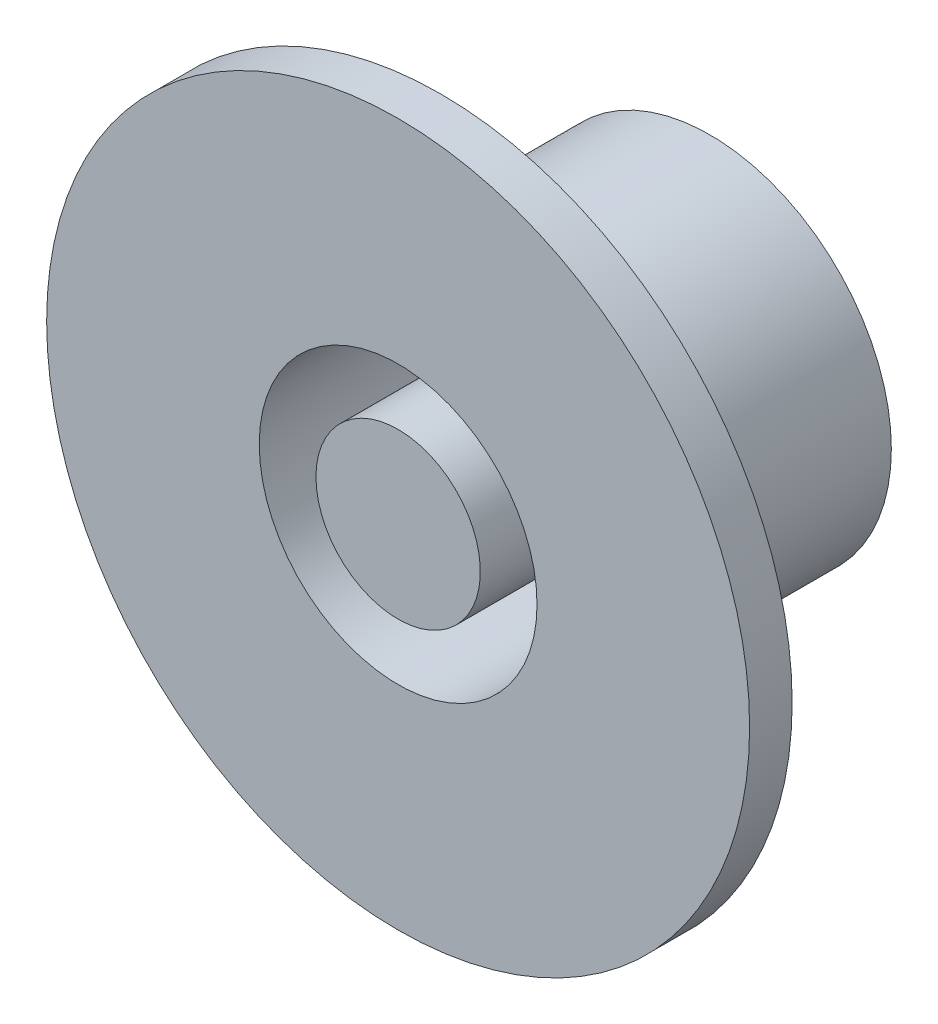
ISO-10303-21;
HEADER;
FILE_DESCRIPTION(('STEP AP214'),'2;1');
FILE_NAME('part.step','',(''),(''),'','','');
FILE_SCHEMA(('AUTOMOTIVE_DESIGN { 1 0 10303 214 1 1 1 1 }'));
ENDSEC;
DATA;
#1=APPLICATION_CONTEXT('core data for automotive mechanical design processes');
#2=APPLICATION_PROTOCOL_DEFINITION('international standard','automotive_design',2000,#1);
#3=PRODUCT_CONTEXT('',#1,'mechanical');
#4=PRODUCT('Part','Part','',(#3));
#5=PRODUCT_RELATED_PRODUCT_CATEGORY('part','',(#4));
#6=PRODUCT_DEFINITION_FORMATION('','',#4);
#7=PRODUCT_DEFINITION_CONTEXT('part definition',#1,'design');
#8=PRODUCT_DEFINITION('design','',#6,#7);
#9=PRODUCT_DEFINITION_SHAPE('','',#8);
#10=(LENGTH_UNIT() NAMED_UNIT(*) SI_UNIT(.MILLI.,.METRE.));
#11=(NAMED_UNIT(*) PLANE_ANGLE_UNIT() SI_UNIT($,.RADIAN.));
#12=(NAMED_UNIT(*) SI_UNIT($,.STERADIAN.) SOLID_ANGLE_UNIT());
#13=UNCERTAINTY_MEASURE_WITH_UNIT(LENGTH_MEASURE(1.E-05),#10,'distance_accuracy_value','');
#14=(GEOMETRIC_REPRESENTATION_CONTEXT(3) GLOBAL_UNCERTAINTY_ASSIGNED_CONTEXT((#13)) GLOBAL_UNIT_ASSIGNED_CONTEXT((#10,
#11,#12)) REPRESENTATION_CONTEXT('',''));
#15=CARTESIAN_POINT('',(0.,0.,0.));
#16=DIRECTION('',(0.,0.,1.));
#17=DIRECTION('',(1.,0.,0.));
#18=AXIS2_PLACEMENT_3D('',#15,#16,#17);
#19=CARTESIAN_POINT('',(0.,0.,22.));
#20=DIRECTION('',(0.,0.,1.));
#21=DIRECTION('',(1.,0.,0.));
#22=AXIS2_PLACEMENT_3D('',#19,#20,#21);
#23=PLANE('',#22);
#24=CARTESIAN_POINT('',(0.,0.,22.));
#25=DIRECTION('',(0.,0.,-1.));
#26=DIRECTION('',(-1.,0.,0.));
#27=AXIS2_PLACEMENT_3D('',#24,#25,#26);
#28=CIRCLE('',#27,5.8);
#29=CARTESIAN_POINT('',(-5.8,0.,22.));
#30=VERTEX_POINT('',#29);
#31=EDGE_CURVE('E10',#30,#30,#28,.T.);
#32=ORIENTED_EDGE('',*,*,#31,.F.);
#33=EDGE_LOOP('',(#32));
#34=FACE_BOUND('',#33,.T.);
#35=ADVANCED_FACE('F37',(#34),#23,.T.);
#36=CARTESIAN_POINT('',(0.,0.,0.));
#37=DIRECTION('',(0.,0.,-1.));
#38=DIRECTION('',(-1.,0.,0.));
#39=AXIS2_PLACEMENT_3D('',#36,#37,#38);
#40=CYLINDRICAL_SURFACE('',#39,5.8);
#41=ORIENTED_EDGE('',*,*,#31,.T.);
#42=EDGE_LOOP('',(#41));
#43=FACE_BOUND('',#42,.T.);
#44=CARTESIAN_POINT('',(0.,0.,3.));
#45=DIRECTION('',(0.,0.,-1.));
#46=DIRECTION('',(-1.,0.,0.));
#47=AXIS2_PLACEMENT_3D('',#44,#45,#46);
#48=CIRCLE('',#47,5.8);
#49=CARTESIAN_POINT('',(-5.8,0.,3.));
#50=VERTEX_POINT('',#49);
#51=EDGE_CURVE('E44',#50,#50,#48,.T.);
#52=ORIENTED_EDGE('',*,*,#51,.F.);
#53=EDGE_LOOP('',(#52));
#54=FACE_BOUND('',#53,.T.);
#55=ADVANCED_FACE('F164',(#43,#54),#40,.T.);
#56=CARTESIAN_POINT('',(0.,5.8,3.));
#57=DIRECTION('',(0.,0.,1.));
#58=DIRECTION('',(1.,0.,0.));
#59=AXIS2_PLACEMENT_3D('',#56,#57,#58);
#60=PLANE('',#59);
#61=CARTESIAN_POINT('',(7.50000000000032,3.18366503443004E-13,3.));
#62=DIRECTION('',(0.,0.,1.));
#63=DIRECTION('',(1.,0.,0.));
#64=AXIS2_PLACEMENT_3D('',#61,#62,#63);
#65=CIRCLE('',#64,1.05000000000024);
#66=CARTESIAN_POINT('',(8.55000000000055,3.18366503443004E-13,3.));
#67=VERTEX_POINT('',#66);
#68=EDGE_CURVE('E118',#67,#67,#65,.T.);
#69=ORIENTED_EDGE('',*,*,#68,.F.);
#70=EDGE_LOOP('',(#69));
#71=FACE_BOUND('',#70,.T.);
#72=CARTESIAN_POINT('',(5.30330085889965,-5.30330085889888,3.));
#73=DIRECTION('',(0.,0.,1.));
#74=DIRECTION('',(1.,0.,0.));
#75=AXIS2_PLACEMENT_3D('',#72,#73,#74);
#76=CIRCLE('',#75,1.05000000000049);
#77=CARTESIAN_POINT('',(6.35330085890014,-5.30330085889888,3.));
#78=VERTEX_POINT('',#77);
#79=EDGE_CURVE('E110',#78,#78,#76,.T.);
#80=ORIENTED_EDGE('',*,*,#79,.F.);
#81=EDGE_LOOP('',(#80));
#82=FACE_BOUND('',#81,.T.);
#83=CARTESIAN_POINT('',(6.36733006886009E-13,-7.5,3.));
#84=DIRECTION('',(0.,0.,1.));
#85=DIRECTION('',(1.,0.,0.));
#86=AXIS2_PLACEMENT_3D('',#83,#84,#85);
#87=CIRCLE('',#86,1.05000000000066);
#88=CARTESIAN_POINT('',(1.0500000000013,-7.5,3.));
#89=VERTEX_POINT('',#88);
#90=EDGE_CURVE('E102',#89,#89,#87,.T.);
#91=ORIENTED_EDGE('',*,*,#90,.F.);
#92=EDGE_LOOP('',(#91));
#93=FACE_BOUND('',#92,.T.);
#94=CARTESIAN_POINT('',(-5.30330085889856,-5.30330085889933,3.));
#95=DIRECTION('',(0.,0.,1.));
#96=DIRECTION('',(1.,0.,0.));
#97=AXIS2_PLACEMENT_3D('',#94,#95,#96);
#98=CIRCLE('',#97,1.05000000000065);
#99=CARTESIAN_POINT('',(-4.25330085889791,-5.30330085889933,3.));
#100=VERTEX_POINT('',#99);
#101=EDGE_CURVE('E93',#100,#100,#98,.T.);
#102=ORIENTED_EDGE('',*,*,#101,.F.);
#103=EDGE_LOOP('',(#102));
#104=FACE_BOUND('',#103,.T.);
#105=CARTESIAN_POINT('',(-5.30330085889904,5.30330085889917,3.));
#106=DIRECTION('',(0.,0.,1.));
#107=DIRECTION('',(1.,0.,0.));
#108=AXIS2_PLACEMENT_3D('',#105,#106,#107);
#109=CIRCLE('',#108,1.05);
#110=CARTESIAN_POINT('',(-4.25330085889904,5.30330085889917,3.));
#111=VERTEX_POINT('',#110);
#112=EDGE_CURVE('E141',#111,#111,#109,.T.);
#113=ORIENTED_EDGE('',*,*,#112,.F.);
#114=EDGE_LOOP('',(#113));
#115=FACE_BOUND('',#114,.T.);
#116=CARTESIAN_POINT('',(0.,7.5,3.));
#117=DIRECTION('',(0.,0.,1.));
#118=DIRECTION('',(1.,0.,0.));
#119=AXIS2_PLACEMENT_3D('',#116,#117,#118);
#120=CIRCLE('',#119,1.05);
#121=CARTESIAN_POINT('',(1.05,7.5,3.));
#122=VERTEX_POINT('',#121);
#123=EDGE_CURVE('E125',#122,#122,#120,.T.);
#124=ORIENTED_EDGE('',*,*,#123,.F.);
#125=EDGE_LOOP('',(#124));
#126=FACE_BOUND('',#125,.T.);
#127=CARTESIAN_POINT('',(-7.49999999999968,-3.19284988542365E-13,3.));
#128=DIRECTION('',(0.,0.,1.));
#129=DIRECTION('',(1.,0.,0.));
#130=AXIS2_PLACEMENT_3D('',#127,#128,#129);
#131=CIRCLE('',#130,1.05000000000047);
#132=CARTESIAN_POINT('',(-6.44999999999921,-3.19284988542365E-13,3.));
#133=VERTEX_POINT('',#132);
#134=EDGE_CURVE('E134',#133,#133,#131,.T.);
#135=ORIENTED_EDGE('',*,*,#134,.F.);
#136=EDGE_LOOP('',(#135));
#137=FACE_BOUND('',#136,.T.);
#138=CARTESIAN_POINT('',(5.30330085889912,5.3033008588991,3.));
#139=DIRECTION('',(0.,0.,1.));
#140=DIRECTION('',(1.,0.,0.));
#141=AXIS2_PLACEMENT_3D('',#138,#139,#140);
#142=CIRCLE('',#141,1.05);
#143=CARTESIAN_POINT('',(6.35330085889912,5.3033008588991,3.));
#144=VERTEX_POINT('',#143);
#145=EDGE_CURVE('E85',#144,#144,#142,.T.);
#146=ORIENTED_EDGE('',*,*,#145,.F.);
#147=EDGE_LOOP('',(#146));
#148=FACE_BOUND('',#147,.T.);
#149=ORIENTED_EDGE('',*,*,#51,.T.);
#150=EDGE_LOOP('',(#149));
#151=FACE_BOUND('',#150,.T.);
#152=CARTESIAN_POINT('',(0.,0.,3.));
#153=DIRECTION('',(0.,0.,-1.));
#154=DIRECTION('',(-1.,0.,0.));
#155=AXIS2_PLACEMENT_3D('',#152,#153,#154);
#156=CIRCLE('',#155,9.8);
#157=CARTESIAN_POINT('',(-9.8,0.,3.));
#158=VERTEX_POINT('',#157);
#159=EDGE_CURVE('E49',#158,#158,#156,.T.);
#160=ORIENTED_EDGE('',*,*,#159,.F.);
#161=EDGE_LOOP('',(#160));
#162=FACE_BOUND('',#161,.T.);
#163=ADVANCED_FACE('F160',(#71,#82,#93,#104,#115,#126,#137,#148,#151,#162),#60,.T.);
#164=CARTESIAN_POINT('',(0.,0.,0.));
#165=DIRECTION('',(0.,0.,-1.));
#166=DIRECTION('',(-1.,0.,0.));
#167=AXIS2_PLACEMENT_3D('',#164,#165,#166);
#168=CYLINDRICAL_SURFACE('',#167,9.8);
#169=ORIENTED_EDGE('',*,*,#159,.T.);
#170=EDGE_LOOP('',(#169));
#171=FACE_BOUND('',#170,.T.);
#172=CARTESIAN_POINT('',(0.,0.,22.));
#173=DIRECTION('',(0.,0.,-1.));
#174=DIRECTION('',(-1.,0.,0.));
#175=AXIS2_PLACEMENT_3D('',#172,#173,#174);
#176=CIRCLE('',#175,9.8);
#177=CARTESIAN_POINT('',(-9.8,0.,22.));
#178=VERTEX_POINT('',#177);
#179=EDGE_CURVE('E54',#178,#178,#176,.T.);
#180=ORIENTED_EDGE('',*,*,#179,.F.);
#181=EDGE_LOOP('',(#180));
#182=FACE_BOUND('',#181,.T.);
#183=ADVANCED_FACE('F163',(#171,#182),#168,.F.);
#184=CARTESIAN_POINT('',(0.,9.8,22.));
#185=DIRECTION('',(0.,0.,1.));
#186=DIRECTION('',(1.,0.,0.));
#187=AXIS2_PLACEMENT_3D('',#184,#185,#186);
#188=PLANE('',#187);
#189=ORIENTED_EDGE('',*,*,#179,.T.);
#190=EDGE_LOOP('',(#189));
#191=FACE_BOUND('',#190,.T.);
#192=CARTESIAN_POINT('',(0.,0.,22.));
#193=DIRECTION('',(0.,0.,-1.));
#194=DIRECTION('',(-1.,0.,0.));
#195=AXIS2_PLACEMENT_3D('',#192,#193,#194);
#196=CIRCLE('',#195,24.8);
#197=CARTESIAN_POINT('',(-24.8,0.,22.));
#198=VERTEX_POINT('',#197);
#199=EDGE_CURVE('E60',#198,#198,#196,.T.);
#200=ORIENTED_EDGE('',*,*,#199,.F.);
#201=EDGE_LOOP('',(#200));
#202=FACE_BOUND('',#201,.T.);
#203=ADVANCED_FACE('F177',(#191,#202),#188,.T.);
#204=CARTESIAN_POINT('',(0.,0.,0.));
#205=DIRECTION('',(0.,0.,-1.));
#206=DIRECTION('',(-1.,0.,0.));
#207=AXIS2_PLACEMENT_3D('',#204,#205,#206);
#208=CYLINDRICAL_SURFACE('',#207,24.8);
#209=ORIENTED_EDGE('',*,*,#199,.T.);
#210=EDGE_LOOP('',(#209));
#211=FACE_BOUND('',#210,.T.);
#212=CARTESIAN_POINT('',(0.,0.,19.));
#213=DIRECTION('',(0.,0.,-1.));
#214=DIRECTION('',(-1.,0.,0.));
#215=AXIS2_PLACEMENT_3D('',#212,#213,#214);
#216=CIRCLE('',#215,24.8);
#217=CARTESIAN_POINT('',(-24.8,0.,19.));
#218=VERTEX_POINT('',#217);
#219=EDGE_CURVE('E64',#218,#218,#216,.T.);
#220=ORIENTED_EDGE('',*,*,#219,.F.);
#221=EDGE_LOOP('',(#220));
#222=FACE_BOUND('',#221,.T.);
#223=ADVANCED_FACE('F183',(#211,#222),#208,.T.);
#224=CARTESIAN_POINT('',(0.,12.8,19.));
#225=DIRECTION('',(0.,0.,-1.));
#226=DIRECTION('',(-1.,0.,0.));
#227=AXIS2_PLACEMENT_3D('',#224,#225,#226);
#228=PLANE('',#227);
#229=ORIENTED_EDGE('',*,*,#219,.T.);
#230=EDGE_LOOP('',(#229));
#231=FACE_BOUND('',#230,.T.);
#232=CARTESIAN_POINT('',(0.,0.,19.));
#233=DIRECTION('',(0.,0.,-1.));
#234=DIRECTION('',(-1.,0.,0.));
#235=AXIS2_PLACEMENT_3D('',#232,#233,#234);
#236=CIRCLE('',#235,12.8);
#237=CARTESIAN_POINT('',(-12.8,0.,19.));
#238=VERTEX_POINT('',#237);
#239=EDGE_CURVE('E68',#238,#238,#236,.T.);
#240=ORIENTED_EDGE('',*,*,#239,.F.);
#241=EDGE_LOOP('',(#240));
#242=FACE_BOUND('',#241,.T.);
#243=ADVANCED_FACE('F189',(#231,#242),#228,.T.);
#244=CARTESIAN_POINT('',(0.,0.,0.));
#245=DIRECTION('',(0.,0.,-1.));
#246=DIRECTION('',(-1.,0.,0.));
#247=AXIS2_PLACEMENT_3D('',#244,#245,#246);
#248=CYLINDRICAL_SURFACE('',#247,12.8);
#249=ORIENTED_EDGE('',*,*,#239,.T.);
#250=EDGE_LOOP('',(#249));
#251=FACE_BOUND('',#250,.T.);
#252=CARTESIAN_POINT('',(0.,0.,0.));
#253=DIRECTION('',(0.,0.,-1.));
#254=DIRECTION('',(-1.,0.,0.));
#255=AXIS2_PLACEMENT_3D('',#252,#253,#254);
#256=CIRCLE('',#255,12.8);
#257=CARTESIAN_POINT('',(-12.8,0.,0.));
#258=VERTEX_POINT('',#257);
#259=EDGE_CURVE('E72',#258,#258,#256,.T.);
#260=ORIENTED_EDGE('',*,*,#259,.F.);
#261=EDGE_LOOP('',(#260));
#262=FACE_BOUND('',#261,.T.);
#263=ADVANCED_FACE('F195',(#251,#262),#248,.T.);
#264=CARTESIAN_POINT('',(0.,4.,0.));
#265=DIRECTION('',(0.,0.,-1.));
#266=DIRECTION('',(-1.,0.,0.));
#267=AXIS2_PLACEMENT_3D('',#264,#265,#266);
#268=PLANE('',#267);
#269=CARTESIAN_POINT('',(7.50000000000032,3.18366503443004E-13,0.));
#270=DIRECTION('',(0.,0.,1.));
#271=DIRECTION('',(1.,0.,0.));
#272=AXIS2_PLACEMENT_3D('',#269,#270,#271);
#273=CIRCLE('',#272,1.05000000000024);
#274=CARTESIAN_POINT('',(8.55000000000055,3.18366503443004E-13,0.));
#275=VERTEX_POINT('',#274);
#276=EDGE_CURVE('E89',#275,#275,#273,.T.);
#277=ORIENTED_EDGE('',*,*,#276,.T.);
#278=EDGE_LOOP('',(#277));
#279=FACE_BOUND('',#278,.T.);
#280=CARTESIAN_POINT('',(5.30330085889965,-5.30330085889888,0.));
#281=DIRECTION('',(0.,0.,1.));
#282=DIRECTION('',(1.,0.,0.));
#283=AXIS2_PLACEMENT_3D('',#280,#281,#282);
#284=CIRCLE('',#283,1.05000000000049);
#285=CARTESIAN_POINT('',(6.35330085890014,-5.30330085889888,0.));
#286=VERTEX_POINT('',#285);
#287=EDGE_CURVE('E114',#286,#286,#284,.T.);
#288=ORIENTED_EDGE('',*,*,#287,.T.);
#289=EDGE_LOOP('',(#288));
#290=FACE_BOUND('',#289,.T.);
#291=CARTESIAN_POINT('',(6.36733006886009E-13,-7.5,0.));
#292=DIRECTION('',(0.,0.,1.));
#293=DIRECTION('',(1.,0.,0.));
#294=AXIS2_PLACEMENT_3D('',#291,#292,#293);
#295=CIRCLE('',#294,1.05000000000066);
#296=CARTESIAN_POINT('',(1.0500000000013,-7.5,0.));
#297=VERTEX_POINT('',#296);
#298=EDGE_CURVE('E106',#297,#297,#295,.T.);
#299=ORIENTED_EDGE('',*,*,#298,.T.);
#300=EDGE_LOOP('',(#299));
#301=FACE_BOUND('',#300,.T.);
#302=CARTESIAN_POINT('',(-5.30330085889856,-5.30330085889933,0.));
#303=DIRECTION('',(0.,0.,1.));
#304=DIRECTION('',(1.,0.,0.));
#305=AXIS2_PLACEMENT_3D('',#302,#303,#304);
#306=CIRCLE('',#305,1.05000000000065);
#307=CARTESIAN_POINT('',(-4.25330085889791,-5.30330085889933,0.));
#308=VERTEX_POINT('',#307);
#309=EDGE_CURVE('E97',#308,#308,#306,.T.);
#310=ORIENTED_EDGE('',*,*,#309,.T.);
#311=EDGE_LOOP('',(#310));
#312=FACE_BOUND('',#311,.T.);
#313=CARTESIAN_POINT('',(-5.30330085889904,5.30330085889917,0.));
#314=DIRECTION('',(0.,0.,1.));
#315=DIRECTION('',(1.,0.,0.));
#316=AXIS2_PLACEMENT_3D('',#313,#314,#315);
#317=CIRCLE('',#316,1.05);
#318=CARTESIAN_POINT('',(-4.25330085889904,5.30330085889917,0.));
#319=VERTEX_POINT('',#318);
#320=EDGE_CURVE('E130',#319,#319,#317,.T.);
#321=ORIENTED_EDGE('',*,*,#320,.T.);
#322=EDGE_LOOP('',(#321));
#323=FACE_BOUND('',#322,.T.);
#324=CARTESIAN_POINT('',(0.,7.5,0.));
#325=DIRECTION('',(0.,0.,1.));
#326=DIRECTION('',(1.,0.,0.));
#327=AXIS2_PLACEMENT_3D('',#324,#325,#326);
#328=CIRCLE('',#327,1.05);
#329=CARTESIAN_POINT('',(1.05,7.5,0.));
#330=VERTEX_POINT('',#329);
#331=EDGE_CURVE('E129',#330,#330,#328,.T.);
#332=ORIENTED_EDGE('',*,*,#331,.T.);
#333=EDGE_LOOP('',(#332));
#334=FACE_BOUND('',#333,.T.);
#335=CARTESIAN_POINT('',(-7.49999999999968,-3.19284988542365E-13,0.));
#336=DIRECTION('',(0.,0.,1.));
#337=DIRECTION('',(1.,0.,0.));
#338=AXIS2_PLACEMENT_3D('',#335,#336,#337);
#339=CIRCLE('',#338,1.05000000000047);
#340=CARTESIAN_POINT('',(-6.44999999999921,-3.19284988542365E-13,0.));
#341=VERTEX_POINT('',#340);
#342=EDGE_CURVE('E98',#341,#341,#339,.T.);
#343=ORIENTED_EDGE('',*,*,#342,.T.);
#344=EDGE_LOOP('',(#343));
#345=FACE_BOUND('',#344,.T.);
#346=CARTESIAN_POINT('',(5.30330085889912,5.3033008588991,0.));
#347=DIRECTION('',(0.,0.,1.));
#348=DIRECTION('',(1.,0.,0.));
#349=AXIS2_PLACEMENT_3D('',#346,#347,#348);
#350=CIRCLE('',#349,1.05);
#351=CARTESIAN_POINT('',(6.35330085889912,5.3033008588991,0.));
#352=VERTEX_POINT('',#351);
#353=EDGE_CURVE('E84',#352,#352,#350,.T.);
#354=ORIENTED_EDGE('',*,*,#353,.T.);
#355=EDGE_LOOP('',(#354));
#356=FACE_BOUND('',#355,.T.);
#357=ORIENTED_EDGE('',*,*,#259,.T.);
#358=EDGE_LOOP('',(#357));
#359=FACE_BOUND('',#358,.T.);
#360=CARTESIAN_POINT('',(0.,0.,0.));
#361=DIRECTION('',(0.,0.,-1.));
#362=DIRECTION('',(-1.,0.,0.));
#363=AXIS2_PLACEMENT_3D('',#360,#361,#362);
#364=CIRCLE('',#363,4.);
#365=CARTESIAN_POINT('',(-4.,0.,0.));
#366=VERTEX_POINT('',#365);
#367=EDGE_CURVE('E76',#366,#366,#364,.T.);
#368=ORIENTED_EDGE('',*,*,#367,.F.);
#369=EDGE_LOOP('',(#368));
#370=FACE_BOUND('',#369,.T.);
#371=ADVANCED_FACE('F149',(#279,#290,#301,#312,#323,#334,#345,#356,#359,#370),#268,.T.);
#372=CARTESIAN_POINT('',(0.,0.,0.));
#373=DIRECTION('',(0.,0.,-1.));
#374=DIRECTION('',(-1.,0.,0.));
#375=AXIS2_PLACEMENT_3D('',#372,#373,#374);
#376=CYLINDRICAL_SURFACE('',#375,4.);
#377=ORIENTED_EDGE('',*,*,#367,.T.);
#378=EDGE_LOOP('',(#377));
#379=FACE_BOUND('',#378,.T.);
#380=CARTESIAN_POINT('',(0.,0.,19.));
#381=DIRECTION('',(0.,0.,-1.));
#382=DIRECTION('',(-1.,0.,0.));
#383=AXIS2_PLACEMENT_3D('',#380,#381,#382);
#384=CIRCLE('',#383,4.);
#385=CARTESIAN_POINT('',(-4.,0.,19.));
#386=VERTEX_POINT('',#385);
#387=EDGE_CURVE('E80',#386,#386,#384,.T.);
#388=ORIENTED_EDGE('',*,*,#387,.F.);
#389=EDGE_LOOP('',(#388));
#390=FACE_BOUND('',#389,.T.);
#391=ADVANCED_FACE('F206',(#379,#390),#376,.F.);
#392=CARTESIAN_POINT('',(0.,4.,19.));
#393=DIRECTION('',(0.,0.,-1.));
#394=DIRECTION('',(-1.,0.,0.));
#395=AXIS2_PLACEMENT_3D('',#392,#393,#394);
#396=PLANE('',#395);
#397=ORIENTED_EDGE('',*,*,#387,.T.);
#398=EDGE_LOOP('',(#397));
#399=FACE_BOUND('',#398,.T.);
#400=ADVANCED_FACE('F213',(#399),#396,.T.);
#401=CARTESIAN_POINT('',(5.30330085889912,5.3033008588991,0.));
#402=DIRECTION('',(0.,0.,1.));
#403=DIRECTION('',(1.,0.,0.));
#404=AXIS2_PLACEMENT_3D('',#401,#402,#403);
#405=CYLINDRICAL_SURFACE('',#404,1.05);
#406=ORIENTED_EDGE('',*,*,#353,.F.);
#407=EDGE_LOOP('',(#406));
#408=FACE_BOUND('',#407,.T.);
#409=ORIENTED_EDGE('',*,*,#145,.T.);
#410=EDGE_LOOP('',(#409));
#411=FACE_BOUND('',#410,.T.);
#412=ADVANCED_FACE('F218',(#408,#411),#405,.F.);
#413=CARTESIAN_POINT('',(-7.49999999999968,-3.19284988542365E-13,0.));
#414=DIRECTION('',(0.,0.,1.));
#415=DIRECTION('',(1.,0.,0.));
#416=AXIS2_PLACEMENT_3D('',#413,#414,#415);
#417=CYLINDRICAL_SURFACE('',#416,1.05000000000047);
#418=ORIENTED_EDGE('',*,*,#342,.F.);
#419=EDGE_LOOP('',(#418));
#420=FACE_BOUND('',#419,.T.);
#421=ORIENTED_EDGE('',*,*,#134,.T.);
#422=EDGE_LOOP('',(#421));
#423=FACE_BOUND('',#422,.T.);
#424=ADVANCED_FACE('F223',(#420,#423),#417,.F.);
#425=CARTESIAN_POINT('',(0.,7.5,0.));
#426=DIRECTION('',(0.,0.,1.));
#427=DIRECTION('',(1.,0.,0.));
#428=AXIS2_PLACEMENT_3D('',#425,#426,#427);
#429=CYLINDRICAL_SURFACE('',#428,1.05);
#430=ORIENTED_EDGE('',*,*,#331,.F.);
#431=EDGE_LOOP('',(#430));
#432=FACE_BOUND('',#431,.T.);
#433=ORIENTED_EDGE('',*,*,#123,.T.);
#434=EDGE_LOOP('',(#433));
#435=FACE_BOUND('',#434,.T.);
#436=ADVANCED_FACE('F156',(#432,#435),#429,.F.);
#437=CARTESIAN_POINT('',(-5.30330085889904,5.30330085889917,0.));
#438=DIRECTION('',(0.,0.,1.));
#439=DIRECTION('',(1.,0.,0.));
#440=AXIS2_PLACEMENT_3D('',#437,#438,#439);
#441=CYLINDRICAL_SURFACE('',#440,1.05);
#442=ORIENTED_EDGE('',*,*,#320,.F.);
#443=EDGE_LOOP('',(#442));
#444=FACE_BOUND('',#443,.T.);
#445=ORIENTED_EDGE('',*,*,#112,.T.);
#446=EDGE_LOOP('',(#445));
#447=FACE_BOUND('',#446,.T.);
#448=ADVANCED_FACE('F152',(#444,#447),#441,.F.);
#449=CARTESIAN_POINT('',(-5.30330085889856,-5.30330085889933,0.));
#450=DIRECTION('',(0.,0.,1.));
#451=DIRECTION('',(1.,0.,0.));
#452=AXIS2_PLACEMENT_3D('',#449,#450,#451);
#453=CYLINDRICAL_SURFACE('',#452,1.05000000000065);
#454=ORIENTED_EDGE('',*,*,#309,.F.);
#455=EDGE_LOOP('',(#454));
#456=FACE_BOUND('',#455,.T.);
#457=ORIENTED_EDGE('',*,*,#101,.T.);
#458=EDGE_LOOP('',(#457));
#459=FACE_BOUND('',#458,.T.);
#460=ADVANCED_FACE('F155',(#456,#459),#453,.F.);
#461=CARTESIAN_POINT('',(6.36733006886009E-13,-7.5,0.));
#462=DIRECTION('',(0.,0.,1.));
#463=DIRECTION('',(1.,0.,0.));
#464=AXIS2_PLACEMENT_3D('',#461,#462,#463);
#465=CYLINDRICAL_SURFACE('',#464,1.05000000000066);
#466=ORIENTED_EDGE('',*,*,#298,.F.);
#467=EDGE_LOOP('',(#466));
#468=FACE_BOUND('',#467,.T.);
#469=ORIENTED_EDGE('',*,*,#90,.T.);
#470=EDGE_LOOP('',(#469));
#471=FACE_BOUND('',#470,.T.);
#472=ADVANCED_FACE('F306',(#468,#471),#465,.F.);
#473=CARTESIAN_POINT('',(5.30330085889965,-5.30330085889888,0.));
#474=DIRECTION('',(0.,0.,1.));
#475=DIRECTION('',(1.,0.,0.));
#476=AXIS2_PLACEMENT_3D('',#473,#474,#475);
#477=CYLINDRICAL_SURFACE('',#476,1.05000000000049);
#478=ORIENTED_EDGE('',*,*,#287,.F.);
#479=EDGE_LOOP('',(#478));
#480=FACE_BOUND('',#479,.T.);
#481=ORIENTED_EDGE('',*,*,#79,.T.);
#482=EDGE_LOOP('',(#481));
#483=FACE_BOUND('',#482,.T.);
#484=ADVANCED_FACE('F315',(#480,#483),#477,.F.);
#485=CARTESIAN_POINT('',(7.50000000000032,3.18366503443004E-13,0.));
#486=DIRECTION('',(0.,0.,1.));
#487=DIRECTION('',(1.,0.,0.));
#488=AXIS2_PLACEMENT_3D('',#485,#486,#487);
#489=CYLINDRICAL_SURFACE('',#488,1.05000000000024);
#490=ORIENTED_EDGE('',*,*,#276,.F.);
#491=EDGE_LOOP('',(#490));
#492=FACE_BOUND('',#491,.T.);
#493=ORIENTED_EDGE('',*,*,#68,.T.);
#494=EDGE_LOOP('',(#493));
#495=FACE_BOUND('',#494,.T.);
#496=ADVANCED_FACE('F324',(#492,#495),#489,.F.);
#497=CLOSED_SHELL('',(#35,#55,#163,#183,#203,#223,#243,#263,#371,#391,#400,#412,#424,#436,#448,
#460,#472,#484,#496));
#498=MANIFOLD_SOLID_BREP('B2',#497);
#499=ADVANCED_BREP_SHAPE_REPRESENTATION('',(#18,#498),#14);
#500=SHAPE_DEFINITION_REPRESENTATION(#9,#499);
ENDSEC;
END-ISO-10303-21;
